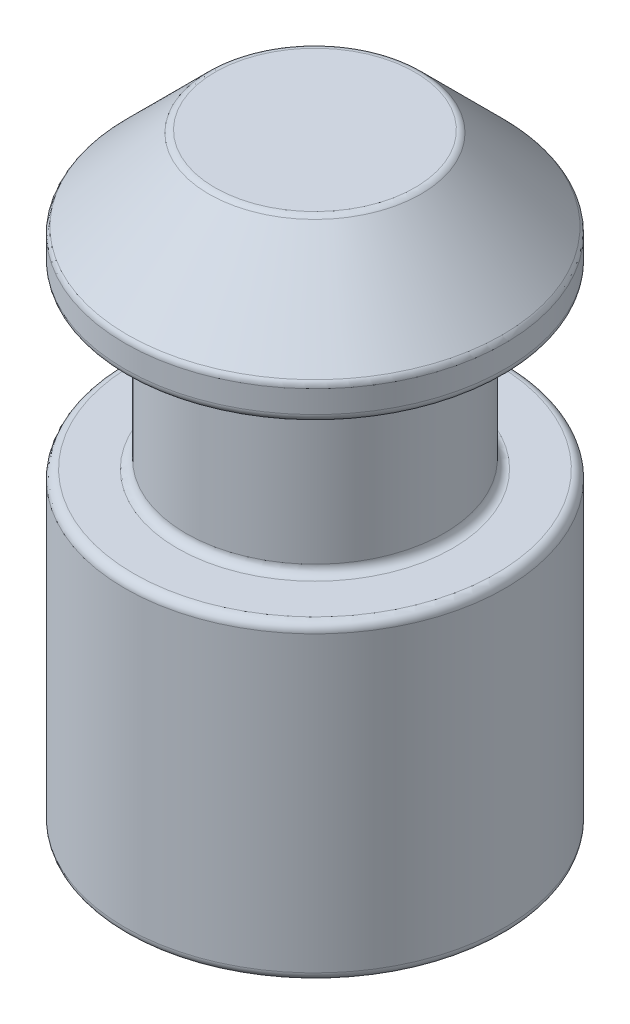
ISO-10303-21;
HEADER;
FILE_DESCRIPTION(('STEP AP214'),'2;1');
FILE_NAME('part.step','',(''),(''),'','','');
FILE_SCHEMA(('AUTOMOTIVE_DESIGN { 1 0 10303 214 1 1 1 1 }'));
ENDSEC;
DATA;
#1=APPLICATION_CONTEXT('core data for automotive mechanical design processes');
#2=APPLICATION_PROTOCOL_DEFINITION('international standard','automotive_design',2000,#1);
#3=PRODUCT_CONTEXT('',#1,'mechanical');
#4=PRODUCT('Part','Part','',(#3));
#5=PRODUCT_RELATED_PRODUCT_CATEGORY('part','',(#4));
#6=PRODUCT_DEFINITION_FORMATION('','',#4);
#7=PRODUCT_DEFINITION_CONTEXT('part definition',#1,'design');
#8=PRODUCT_DEFINITION('design','',#6,#7);
#9=PRODUCT_DEFINITION_SHAPE('','',#8);
#10=(LENGTH_UNIT() NAMED_UNIT(*) SI_UNIT(.MILLI.,.METRE.));
#11=(NAMED_UNIT(*) PLANE_ANGLE_UNIT() SI_UNIT($,.RADIAN.));
#12=(NAMED_UNIT(*) SI_UNIT($,.STERADIAN.) SOLID_ANGLE_UNIT());
#13=UNCERTAINTY_MEASURE_WITH_UNIT(LENGTH_MEASURE(1.E-05),#10,'distance_accuracy_value','');
#14=(GEOMETRIC_REPRESENTATION_CONTEXT(3) GLOBAL_UNCERTAINTY_ASSIGNED_CONTEXT((#13)) GLOBAL_UNIT_ASSIGNED_CONTEXT((#10,
#11,#12)) REPRESENTATION_CONTEXT('',''));
#15=CARTESIAN_POINT('',(0.,0.,0.));
#16=DIRECTION('',(0.,0.,1.));
#17=DIRECTION('',(1.,0.,0.));
#18=AXIS2_PLACEMENT_3D('',#15,#16,#17);
#19=CARTESIAN_POINT('',(0.,3.5,0.));
#20=DIRECTION('',(0.,-1.,0.));
#21=DIRECTION('',(0.,0.,-1.));
#22=AXIS2_PLACEMENT_3D('',#19,#20,#21);
#23=CYLINDRICAL_SURFACE('',#22,1.1);
#24=CARTESIAN_POINT('',(0.,2.97928932188134,0.));
#25=DIRECTION('',(0.,1.,0.));
#26=DIRECTION('',(0.,0.,1.));
#27=AXIS2_PLACEMENT_3D('',#24,#25,#26);
#28=CIRCLE('',#27,1.1);
#29=CARTESIAN_POINT('',(0.,2.97928932188134,1.1));
#30=VERTEX_POINT('',#29);
#31=EDGE_CURVE('E75',#30,#30,#28,.F.);
#32=ORIENTED_EDGE('',*,*,#31,.T.);
#33=EDGE_LOOP('',(#32));
#34=FACE_BOUND('',#33,.T.);
#35=CARTESIAN_POINT('',(0.,2.85,0.));
#36=DIRECTION('',(0.,1.,0.));
#37=DIRECTION('',(0.,0.,1.));
#38=AXIS2_PLACEMENT_3D('',#35,#36,#37);
#39=CIRCLE('',#38,1.1);
#40=CARTESIAN_POINT('',(0.,2.85,1.1));
#41=VERTEX_POINT('',#40);
#42=EDGE_CURVE('E78',#41,#41,#39,.T.);
#43=ORIENTED_EDGE('',*,*,#42,.T.);
#44=EDGE_LOOP('',(#43));
#45=FACE_BOUND('',#44,.T.);
#46=ADVANCED_FACE('F31',(#34,#45),#23,.T.);
#47=CARTESIAN_POINT('',(0.,3.5,0.));
#48=DIRECTION('',(0.,1.,0.));
#49=DIRECTION('',(0.,0.,1.));
#50=AXIS2_PLACEMENT_3D('',#47,#48,#49);
#51=PLANE('',#50);
#52=CARTESIAN_POINT('',(0.,3.5,0.));
#53=DIRECTION('',(0.,1.,0.));
#54=DIRECTION('',(0.,0.,1.));
#55=AXIS2_PLACEMENT_3D('',#52,#53,#54);
#56=CIRCLE('',#55,0.579289321881346);
#57=CARTESIAN_POINT('',(0.,3.5,0.579289321881346));
#58=VERTEX_POINT('',#57);
#59=EDGE_CURVE('E66',#58,#58,#56,.T.);
#60=ORIENTED_EDGE('',*,*,#59,.T.);
#61=EDGE_LOOP('',(#60));
#62=FACE_BOUND('',#61,.T.);
#63=ADVANCED_FACE('F99',(#62),#51,.T.);
#64=CARTESIAN_POINT('',(0.,3.5,0.));
#65=DIRECTION('',(0.,-1.,0.));
#66=DIRECTION('',(0.,0.,-1.));
#67=AXIS2_PLACEMENT_3D('',#64,#65,#66);
#68=CONICAL_SURFACE('',#67,0.6,0.785398163397447);
#69=CARTESIAN_POINT('',(0.,3.01464466094067,0.));
#70=DIRECTION('',(0.,-1.,0.));
#71=DIRECTION('',(0.,0.,-1.));
#72=AXIS2_PLACEMENT_3D('',#69,#70,#71);
#73=CIRCLE('',#72,1.08535533905933);
#74=CARTESIAN_POINT('',(0.,3.01464466094067,-1.08535533905933));
#75=VERTEX_POINT('',#74);
#76=EDGE_CURVE('E69',#75,#75,#73,.F.);
#77=ORIENTED_EDGE('',*,*,#76,.T.);
#78=EDGE_LOOP('',(#77));
#79=FACE_BOUND('',#78,.T.);
#80=CARTESIAN_POINT('',(0.,3.48535533905933,0.));
#81=DIRECTION('',(0.,1.,0.));
#82=DIRECTION('',(0.,0.,1.));
#83=AXIS2_PLACEMENT_3D('',#80,#81,#82);
#84=CIRCLE('',#83,0.614644660940673);
#85=CARTESIAN_POINT('',(0.,3.48535533905933,0.614644660940673));
#86=VERTEX_POINT('',#85);
#87=EDGE_CURVE('E72',#86,#86,#84,.F.);
#88=ORIENTED_EDGE('',*,*,#87,.T.);
#89=EDGE_LOOP('',(#88));
#90=FACE_BOUND('',#89,.T.);
#91=ADVANCED_FACE('F106',(#79,#90),#68,.T.);
#92=CARTESIAN_POINT('',(0.,1.8,0.));
#93=DIRECTION('',(0.,1.,0.));
#94=DIRECTION('',(0.,0.,1.));
#95=AXIS2_PLACEMENT_3D('',#92,#93,#94);
#96=PLANE('',#95);
#97=CARTESIAN_POINT('',(0.,1.8,0.));
#98=DIRECTION('',(0.,1.,0.));
#99=DIRECTION('',(0.,0.,1.));
#100=AXIS2_PLACEMENT_3D('',#97,#98,#99);
#101=CIRCLE('',#100,1.05);
#102=CARTESIAN_POINT('',(0.,1.8,1.05));
#103=VERTEX_POINT('',#102);
#104=EDGE_CURVE('E51',#103,#103,#101,.T.);
#105=ORIENTED_EDGE('',*,*,#104,.T.);
#106=EDGE_LOOP('',(#105));
#107=FACE_BOUND('',#106,.T.);
#108=CARTESIAN_POINT('',(0.,1.8,0.));
#109=DIRECTION('',(0.,1.,0.));
#110=DIRECTION('',(0.,0.,1.));
#111=AXIS2_PLACEMENT_3D('',#108,#109,#110);
#112=CIRCLE('',#111,0.797130162751053);
#113=CARTESIAN_POINT('',(0.,1.8,0.797130162751053));
#114=VERTEX_POINT('',#113);
#115=EDGE_CURVE('E54',#114,#114,#112,.F.);
#116=ORIENTED_EDGE('',*,*,#115,.T.);
#117=EDGE_LOOP('',(#116));
#118=FACE_BOUND('',#117,.T.);
#119=ADVANCED_FACE('F130',(#107,#118),#96,.T.);
#120=CARTESIAN_POINT('',(0.,2.8,0.));
#121=DIRECTION('',(0.,1.,0.));
#122=DIRECTION('',(0.,0.,1.));
#123=AXIS2_PLACEMENT_3D('',#120,#121,#122);
#124=PLANE('',#123);
#125=CARTESIAN_POINT('',(0.,2.8,0.));
#126=DIRECTION('',(0.,1.,0.));
#127=DIRECTION('',(0.,0.,1.));
#128=AXIS2_PLACEMENT_3D('',#125,#126,#127);
#129=CIRCLE('',#128,1.05);
#130=CARTESIAN_POINT('',(0.,2.8,1.05));
#131=VERTEX_POINT('',#130);
#132=EDGE_CURVE('E42',#131,#131,#129,.F.);
#133=ORIENTED_EDGE('',*,*,#132,.T.);
#134=EDGE_LOOP('',(#133));
#135=FACE_BOUND('',#134,.T.);
#136=CARTESIAN_POINT('',(0.,2.8,0.));
#137=DIRECTION('',(0.,1.,0.));
#138=DIRECTION('',(0.,0.,1.));
#139=AXIS2_PLACEMENT_3D('',#136,#137,#138);
#140=CIRCLE('',#139,0.797130162751053);
#141=CARTESIAN_POINT('',(0.,2.8,0.797130162751053));
#142=VERTEX_POINT('',#141);
#143=EDGE_CURVE('E46',#142,#142,#140,.T.);
#144=ORIENTED_EDGE('',*,*,#143,.T.);
#145=EDGE_LOOP('',(#144));
#146=FACE_BOUND('',#145,.T.);
#147=ADVANCED_FACE('F133',(#135,#146),#124,.F.);
#148=CARTESIAN_POINT('',(0.,1.8,0.));
#149=DIRECTION('',(0.,1.,0.));
#150=DIRECTION('',(0.,0.,1.));
#151=AXIS2_PLACEMENT_3D('',#148,#149,#150);
#152=CYLINDRICAL_SURFACE('',#151,0.747130162751053);
#153=CARTESIAN_POINT('',(0.,1.85,0.));
#154=DIRECTION('',(0.,1.,0.));
#155=DIRECTION('',(0.,0.,1.));
#156=AXIS2_PLACEMENT_3D('',#153,#154,#155);
#157=CIRCLE('',#156,0.747130162751053);
#158=CARTESIAN_POINT('',(0.,1.85,0.747130162751053));
#159=VERTEX_POINT('',#158);
#160=EDGE_CURVE('E10',#159,#159,#157,.T.);
#161=ORIENTED_EDGE('',*,*,#160,.T.);
#162=EDGE_LOOP('',(#161));
#163=FACE_BOUND('',#162,.T.);
#164=CARTESIAN_POINT('',(0.,2.75,0.));
#165=DIRECTION('',(0.,1.,0.));
#166=DIRECTION('',(0.,0.,1.));
#167=AXIS2_PLACEMENT_3D('',#164,#165,#166);
#168=CIRCLE('',#167,0.747130162751053);
#169=CARTESIAN_POINT('',(0.,2.75,0.747130162751053));
#170=VERTEX_POINT('',#169);
#171=EDGE_CURVE('E38',#170,#170,#168,.F.);
#172=ORIENTED_EDGE('',*,*,#171,.T.);
#173=EDGE_LOOP('',(#172));
#174=FACE_BOUND('',#173,.T.);
#175=ADVANCED_FACE('F122',(#163,#174),#152,.T.);
#176=CARTESIAN_POINT('',(0.,0.,0.));
#177=DIRECTION('',(0.,1.,0.));
#178=DIRECTION('',(0.,0.,1.));
#179=AXIS2_PLACEMENT_3D('',#176,#177,#178);
#180=PLANE('',#179);
#181=CARTESIAN_POINT('',(0.,0.,0.));
#182=DIRECTION('',(0.,1.,0.));
#183=DIRECTION('',(0.,0.,1.));
#184=AXIS2_PLACEMENT_3D('',#181,#182,#183);
#185=CIRCLE('',#184,1.05);
#186=CARTESIAN_POINT('',(0.,0.,1.05));
#187=VERTEX_POINT('',#186);
#188=EDGE_CURVE('E57',#187,#187,#185,.F.);
#189=ORIENTED_EDGE('',*,*,#188,.T.);
#190=EDGE_LOOP('',(#189));
#191=FACE_BOUND('',#190,.T.);
#192=ADVANCED_FACE('F113',(#191),#180,.F.);
#193=CARTESIAN_POINT('',(0.,0.0500000000000001,0.));
#194=DIRECTION('',(0.,1.,0.));
#195=DIRECTION('',(0.,0.,1.));
#196=AXIS2_PLACEMENT_3D('',#193,#194,#195);
#197=CIRCLE('',#196,1.1);
#198=CARTESIAN_POINT('',(0.,0.0500000000000001,1.1));
#199=VERTEX_POINT('',#198);
#200=EDGE_CURVE('E60',#199,#199,#197,.T.);
#201=ORIENTED_EDGE('',*,*,#200,.T.);
#202=EDGE_LOOP('',(#201));
#203=FACE_BOUND('',#202,.T.);
#204=CARTESIAN_POINT('',(0.,1.75,0.));
#205=DIRECTION('',(0.,1.,0.));
#206=DIRECTION('',(0.,0.,1.));
#207=AXIS2_PLACEMENT_3D('',#204,#205,#206);
#208=CIRCLE('',#207,1.1);
#209=CARTESIAN_POINT('',(0.,1.75,1.1));
#210=VERTEX_POINT('',#209);
#211=EDGE_CURVE('E63',#210,#210,#208,.F.);
#212=ORIENTED_EDGE('',*,*,#211,.T.);
#213=EDGE_LOOP('',(#212));
#214=FACE_BOUND('',#213,.T.);
#215=ADVANCED_FACE('F102',(#203,#214),#23,.T.);
#216=CARTESIAN_POINT('',(0.,2.97928932188134,0.));
#217=DIRECTION('',(0.,1.,0.));
#218=DIRECTION('',(0.,0.,1.));
#219=AXIS2_PLACEMENT_3D('',#216,#217,#218);
#220=TOROIDAL_SURFACE('',#219,1.05,0.05);
#221=ORIENTED_EDGE('',*,*,#76,.F.);
#222=EDGE_LOOP('',(#221));
#223=FACE_BOUND('',#222,.T.);
#224=ORIENTED_EDGE('',*,*,#31,.F.);
#225=EDGE_LOOP('',(#224));
#226=FACE_BOUND('',#225,.T.);
#227=ADVANCED_FACE('F112',(#223,#226),#220,.T.);
#228=CARTESIAN_POINT('',(0.,3.45,0.));
#229=DIRECTION('',(0.,1.,0.));
#230=DIRECTION('',(0.,0.,1.));
#231=AXIS2_PLACEMENT_3D('',#228,#229,#230);
#232=TOROIDAL_SURFACE('',#231,0.579289321881346,0.05);
#233=ORIENTED_EDGE('',*,*,#87,.F.);
#234=EDGE_LOOP('',(#233));
#235=FACE_BOUND('',#234,.T.);
#236=ORIENTED_EDGE('',*,*,#59,.F.);
#237=EDGE_LOOP('',(#236));
#238=FACE_BOUND('',#237,.T.);
#239=ADVANCED_FACE('F119',(#235,#238),#232,.T.);
#240=CARTESIAN_POINT('',(0.,0.0500000000000001,0.));
#241=DIRECTION('',(0.,1.,0.));
#242=DIRECTION('',(0.,0.,1.));
#243=AXIS2_PLACEMENT_3D('',#240,#241,#242);
#244=TOROIDAL_SURFACE('',#243,1.05,0.05);
#245=ORIENTED_EDGE('',*,*,#188,.F.);
#246=EDGE_LOOP('',(#245));
#247=FACE_BOUND('',#246,.T.);
#248=ORIENTED_EDGE('',*,*,#200,.F.);
#249=EDGE_LOOP('',(#248));
#250=FACE_BOUND('',#249,.T.);
#251=ADVANCED_FACE('F94',(#247,#250),#244,.T.);
#252=CARTESIAN_POINT('',(0.,1.75,0.));
#253=DIRECTION('',(0.,1.,0.));
#254=DIRECTION('',(0.,0.,1.));
#255=AXIS2_PLACEMENT_3D('',#252,#253,#254);
#256=TOROIDAL_SURFACE('',#255,1.05,0.05);
#257=ORIENTED_EDGE('',*,*,#211,.F.);
#258=EDGE_LOOP('',(#257));
#259=FACE_BOUND('',#258,.T.);
#260=ORIENTED_EDGE('',*,*,#104,.F.);
#261=EDGE_LOOP('',(#260));
#262=FACE_BOUND('',#261,.T.);
#263=ADVANCED_FACE('F86',(#259,#262),#256,.T.);
#264=CARTESIAN_POINT('',(0.,2.85,0.));
#265=DIRECTION('',(0.,1.,0.));
#266=DIRECTION('',(0.,0.,1.));
#267=AXIS2_PLACEMENT_3D('',#264,#265,#266);
#268=TOROIDAL_SURFACE('',#267,1.05,0.05);
#269=ORIENTED_EDGE('',*,*,#132,.F.);
#270=EDGE_LOOP('',(#269));
#271=FACE_BOUND('',#270,.T.);
#272=ORIENTED_EDGE('',*,*,#42,.F.);
#273=EDGE_LOOP('',(#272));
#274=FACE_BOUND('',#273,.T.);
#275=ADVANCED_FACE('F83',(#271,#274),#268,.T.);
#276=CARTESIAN_POINT('',(0.,1.85,0.));
#277=DIRECTION('',(0.,1.,0.));
#278=DIRECTION('',(0.,0.,1.));
#279=AXIS2_PLACEMENT_3D('',#276,#277,#278);
#280=TOROIDAL_SURFACE('',#279,0.797130162751053,0.05);
#281=ORIENTED_EDGE('',*,*,#115,.F.);
#282=EDGE_LOOP('',(#281));
#283=FACE_BOUND('',#282,.T.);
#284=ORIENTED_EDGE('',*,*,#160,.F.);
#285=EDGE_LOOP('',(#284));
#286=FACE_BOUND('',#285,.T.);
#287=ADVANCED_FACE('F85',(#283,#286),#280,.F.);
#288=CARTESIAN_POINT('',(0.,2.75,0.));
#289=DIRECTION('',(0.,1.,0.));
#290=DIRECTION('',(0.,0.,1.));
#291=AXIS2_PLACEMENT_3D('',#288,#289,#290);
#292=TOROIDAL_SURFACE('',#291,0.797130162751053,0.05);
#293=ORIENTED_EDGE('',*,*,#171,.F.);
#294=EDGE_LOOP('',(#293));
#295=FACE_BOUND('',#294,.T.);
#296=ORIENTED_EDGE('',*,*,#143,.F.);
#297=EDGE_LOOP('',(#296));
#298=FACE_BOUND('',#297,.T.);
#299=ADVANCED_FACE('F33',(#295,#298),#292,.F.);
#300=CLOSED_SHELL('',(#46,#63,#91,#119,#147,#175,#192,#215,#227,#239,#251,#263,#275,#287,#299));
#301=MANIFOLD_SOLID_BREP('B2',#300);
#302=ADVANCED_BREP_SHAPE_REPRESENTATION('',(#18,#301),#14);
#303=SHAPE_DEFINITION_REPRESENTATION(#9,#302);
ENDSEC;
END-ISO-10303-21;
